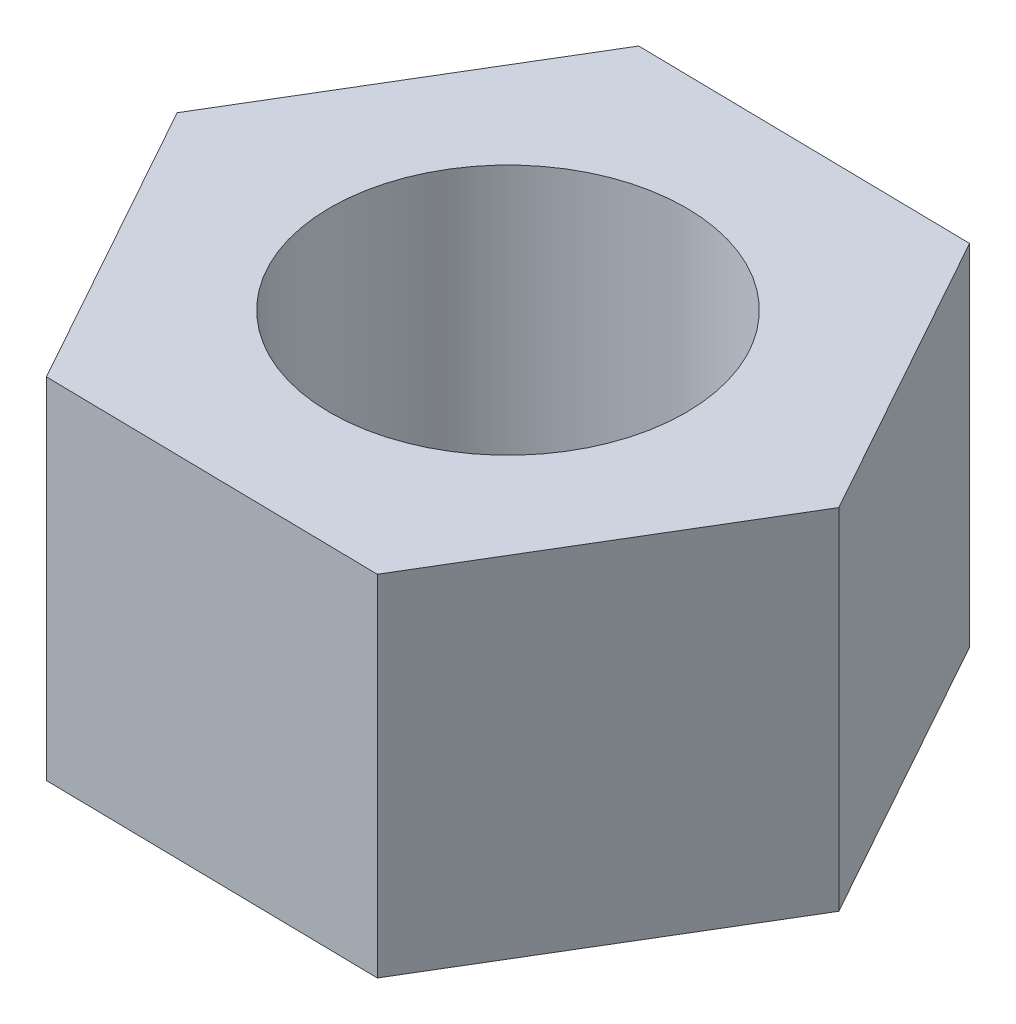
ISO-10303-21;
HEADER;
FILE_DESCRIPTION(('STEP AP214'),'2;1');
FILE_NAME('part.step','',(''),(''),'','','');
FILE_SCHEMA(('AUTOMOTIVE_DESIGN { 1 0 10303 214 1 1 1 1 }'));
ENDSEC;
DATA;
#1=APPLICATION_CONTEXT('core data for automotive mechanical design processes');
#2=APPLICATION_PROTOCOL_DEFINITION('international standard','automotive_design',2000,#1);
#3=PRODUCT_CONTEXT('',#1,'mechanical');
#4=PRODUCT('Part','Part','',(#3));
#5=PRODUCT_RELATED_PRODUCT_CATEGORY('part','',(#4));
#6=PRODUCT_DEFINITION_FORMATION('','',#4);
#7=PRODUCT_DEFINITION_CONTEXT('part definition',#1,'design');
#8=PRODUCT_DEFINITION('design','',#6,#7);
#9=PRODUCT_DEFINITION_SHAPE('','',#8);
#10=(LENGTH_UNIT() NAMED_UNIT(*) SI_UNIT(.MILLI.,.METRE.));
#11=(NAMED_UNIT(*) PLANE_ANGLE_UNIT() SI_UNIT($,.RADIAN.));
#12=(NAMED_UNIT(*) SI_UNIT($,.STERADIAN.) SOLID_ANGLE_UNIT());
#13=UNCERTAINTY_MEASURE_WITH_UNIT(LENGTH_MEASURE(1.E-05),#10,'distance_accuracy_value','');
#14=(GEOMETRIC_REPRESENTATION_CONTEXT(3) GLOBAL_UNCERTAINTY_ASSIGNED_CONTEXT((#13)) GLOBAL_UNIT_ASSIGNED_CONTEXT((#10,
#11,#12)) REPRESENTATION_CONTEXT('',''));
#15=CARTESIAN_POINT('',(0.,0.,0.));
#16=DIRECTION('',(0.,0.,1.));
#17=DIRECTION('',(1.,0.,0.));
#18=AXIS2_PLACEMENT_3D('',#15,#16,#17);
#19=CARTESIAN_POINT('',(-1.484427997689,3.,2.475844674654));
#20=DIRECTION('',(0.016499522491723,0.,-0.999863873613576));
#21=DIRECTION('',(-0.999863873613576,0.,-0.016499522491723));
#22=AXIS2_PLACEMENT_3D('',#19,#20,#21);
#23=PLANE('',#22);
#24=DIRECTION('',(0.999863873613579,0.,0.0164995224915552));
#25=VECTOR('',#24,1.);
#26=CARTESIAN_POINT('',(-1.484427997689,3.,2.475844674654));
#27=LINE('',#26,#25);
#28=CARTESIAN_POINT('',(-1.48442799768877,3.,2.47584467465387));
#29=VERTEX_POINT('',#28);
#30=CARTESIAN_POINT('',(1.40193038523,3.,2.52347469341424));
#31=VERTEX_POINT('',#30);
#32=EDGE_CURVE('E87',#29,#31,#27,.T.);
#33=ORIENTED_EDGE('',*,*,#32,.F.);
#34=DIRECTION('',(0.,1.,0.));
#35=VECTOR('',#34,1.);
#36=CARTESIAN_POINT('',(-1.48442799768855,3.,2.47584467465375));
#37=LINE('',#36,#35);
#38=CARTESIAN_POINT('',(-1.48442799768889,0.,2.47584467465394));
#39=VERTEX_POINT('',#38);
#40=EDGE_CURVE('E78',#29,#39,#37,.F.);
#41=ORIENTED_EDGE('',*,*,#40,.T.);
#42=DIRECTION('',(0.999863873613579,0.,0.0164995224915552));
#43=VECTOR('',#42,1.);
#44=CARTESIAN_POINT('',(-1.484427997689,0.,2.475844674654));
#45=LINE('',#44,#43);
#46=CARTESIAN_POINT('',(1.40193038523,0.,2.52347469341424));
#47=VERTEX_POINT('',#46);
#48=EDGE_CURVE('E106',#39,#47,#45,.T.);
#49=ORIENTED_EDGE('',*,*,#48,.T.);
#50=DIRECTION('',(0.,1.,0.));
#51=VECTOR('',#50,1.);
#52=CARTESIAN_POINT('',(1.40193038523,3.,2.523474693414));
#53=LINE('',#52,#51);
#54=EDGE_CURVE('E101',#47,#31,#53,.T.);
#55=ORIENTED_EDGE('',*,*,#54,.T.);
#56=EDGE_LOOP('',(#33,#41,#49,#55));
#57=FACE_BOUND('',#56,.T.);
#58=ADVANCED_FACE('F17',(#57),#23,.F.);
#59=CARTESIAN_POINT('',(1.40193038523,3.,2.523474693414));
#60=DIRECTION('',(-0.85765775362983,0.,-0.514220942434898));
#61=DIRECTION('',(-0.514220942434898,0.,0.85765775362983));
#62=AXIS2_PLACEMENT_3D('',#59,#60,#61);
#63=PLANE('',#62);
#64=DIRECTION('',(0.514220942435023,0.,-0.857657753629754));
#65=VECTOR('',#64,1.);
#66=CARTESIAN_POINT('',(1.40193038523,3.,2.523474693414));
#67=LINE('',#66,#65);
#68=CARTESIAN_POINT('',(2.88635838291882,3.,0.0476300187603813));
#69=VERTEX_POINT('',#68);
#70=EDGE_CURVE('E89',#31,#69,#67,.T.);
#71=ORIENTED_EDGE('',*,*,#70,.F.);
#72=ORIENTED_EDGE('',*,*,#54,.F.);
#73=DIRECTION('',(0.514220942435023,0.,-0.857657753629754));
#74=VECTOR('',#73,1.);
#75=CARTESIAN_POINT('',(1.40193038523,0.,2.523474693414));
#76=LINE('',#75,#74);
#77=CARTESIAN_POINT('',(2.88635838291882,0.,0.0476300187603813));
#78=VERTEX_POINT('',#77);
#79=EDGE_CURVE('E117',#47,#78,#76,.T.);
#80=ORIENTED_EDGE('',*,*,#79,.T.);
#81=DIRECTION('',(0.,1.,0.));
#82=VECTOR('',#81,1.);
#83=CARTESIAN_POINT('',(2.886358382919,3.,0.04763001876049));
#84=LINE('',#83,#82);
#85=EDGE_CURVE('E98',#78,#69,#84,.T.);
#86=ORIENTED_EDGE('',*,*,#85,.T.);
#87=EDGE_LOOP('',(#71,#72,#80,#86));
#88=FACE_BOUND('',#87,.T.);
#89=ADVANCED_FACE('F110',(#88),#63,.F.);
#90=CARTESIAN_POINT('',(2.886358382919,3.,0.04763001876049));
#91=DIRECTION('',(-0.874157276121491,0.,0.485642931178717));
#92=DIRECTION('',(0.485642931178717,0.,0.874157276121491));
#93=AXIS2_PLACEMENT_3D('',#90,#91,#92);
#94=PLANE('',#93);
#95=DIRECTION('',(-0.48564293117856,0.,-0.874157276121578));
#96=VECTOR('',#95,1.);
#97=CARTESIAN_POINT('',(2.886358382919,3.,0.04763001876049));
#98=LINE('',#97,#96);
#99=CARTESIAN_POINT('',(1.48442799768877,3.,-2.47584467465387));
#100=VERTEX_POINT('',#99);
#101=EDGE_CURVE('E112',#69,#100,#98,.T.);
#102=ORIENTED_EDGE('',*,*,#101,.F.);
#103=ORIENTED_EDGE('',*,*,#85,.F.);
#104=DIRECTION('',(-0.48564293117856,0.,-0.874157276121578));
#105=VECTOR('',#104,1.);
#106=CARTESIAN_POINT('',(2.886358382919,0.,0.04763001876049));
#107=LINE('',#106,#105);
#108=CARTESIAN_POINT('',(1.48442799768877,0.,-2.47584467465387));
#109=VERTEX_POINT('',#108);
#110=EDGE_CURVE('E119',#78,#109,#107,.T.);
#111=ORIENTED_EDGE('',*,*,#110,.T.);
#112=DIRECTION('',(0.,1.,0.));
#113=VECTOR('',#112,1.);
#114=CARTESIAN_POINT('',(1.484427997689,3.,-2.475844674654));
#115=LINE('',#114,#113);
#116=EDGE_CURVE('E95',#109,#100,#115,.T.);
#117=ORIENTED_EDGE('',*,*,#116,.T.);
#118=EDGE_LOOP('',(#102,#103,#111,#117));
#119=FACE_BOUND('',#118,.T.);
#120=ADVANCED_FACE('F144',(#119),#94,.F.);
#121=CARTESIAN_POINT('',(1.484427997689,3.,-2.475844674654));
#122=DIRECTION('',(-0.016499522491723,0.,0.999863873613576));
#123=DIRECTION('',(0.999863873613576,0.,0.016499522491723));
#124=AXIS2_PLACEMENT_3D('',#121,#122,#123);
#125=PLANE('',#124);
#126=DIRECTION('',(-0.999863873613579,0.,-0.0164995224915552));
#127=VECTOR('',#126,1.);
#128=CARTESIAN_POINT('',(1.484427997689,3.,-2.475844674654));
#129=LINE('',#128,#127);
#130=CARTESIAN_POINT('',(-1.40193038523,3.,-2.52347469341412));
#131=VERTEX_POINT('',#130);
#132=EDGE_CURVE('E76',#100,#131,#129,.T.);
#133=ORIENTED_EDGE('',*,*,#132,.F.);
#134=ORIENTED_EDGE('',*,*,#116,.F.);
#135=DIRECTION('',(-0.999863873613579,0.,-0.0164995224915552));
#136=VECTOR('',#135,1.);
#137=CARTESIAN_POINT('',(1.484427997689,0.,-2.475844674654));
#138=LINE('',#137,#136);
#139=CARTESIAN_POINT('',(-1.40193038523,0.,-2.52347469341424));
#140=VERTEX_POINT('',#139);
#141=EDGE_CURVE('E122',#109,#140,#138,.T.);
#142=ORIENTED_EDGE('',*,*,#141,.T.);
#143=DIRECTION('',(0.,1.,0.));
#144=VECTOR('',#143,1.);
#145=CARTESIAN_POINT('',(-1.40193038523,3.,-2.523474693414));
#146=LINE('',#145,#144);
#147=EDGE_CURVE('E66',#140,#131,#146,.T.);
#148=ORIENTED_EDGE('',*,*,#147,.T.);
#149=EDGE_LOOP('',(#133,#134,#142,#148));
#150=FACE_BOUND('',#149,.T.);
#151=ADVANCED_FACE('F142',(#150),#125,.F.);
#152=CARTESIAN_POINT('',(-1.40193038523,3.,-2.523474693414));
#153=DIRECTION('',(0.85765775362983,0.,0.514220942434898));
#154=DIRECTION('',(0.514220942434898,0.,-0.85765775362983));
#155=AXIS2_PLACEMENT_3D('',#152,#153,#154);
#156=PLANE('',#155);
#157=DIRECTION('',(-0.514220942435023,0.,0.857657753629754));
#158=VECTOR('',#157,1.);
#159=CARTESIAN_POINT('',(-1.40193038523,3.,-2.523474693414));
#160=LINE('',#159,#158);
#161=CARTESIAN_POINT('',(-2.88635838291882,3.,-0.0476300187603813));
#162=VERTEX_POINT('',#161);
#163=EDGE_CURVE('E72',#131,#162,#160,.T.);
#164=ORIENTED_EDGE('',*,*,#163,.F.);
#165=ORIENTED_EDGE('',*,*,#147,.F.);
#166=DIRECTION('',(-0.514220942435023,0.,0.857657753629754));
#167=VECTOR('',#166,1.);
#168=CARTESIAN_POINT('',(-1.40193038523,0.,-2.523474693414));
#169=LINE('',#168,#167);
#170=CARTESIAN_POINT('',(-2.88635838291882,0.,-0.0476300187603813));
#171=VERTEX_POINT('',#170);
#172=EDGE_CURVE('E83',#140,#171,#169,.T.);
#173=ORIENTED_EDGE('',*,*,#172,.T.);
#174=DIRECTION('',(0.,1.,0.));
#175=VECTOR('',#174,1.);
#176=CARTESIAN_POINT('',(-2.886358382919,3.,-0.04763001876049));
#177=LINE('',#176,#175);
#178=EDGE_CURVE('E33',#171,#162,#177,.T.);
#179=ORIENTED_EDGE('',*,*,#178,.T.);
#180=EDGE_LOOP('',(#164,#165,#173,#179));
#181=FACE_BOUND('',#180,.T.);
#182=ADVANCED_FACE('F81',(#181),#156,.F.);
#183=CARTESIAN_POINT('',(-2.886358382919,3.,-0.04763001876049));
#184=DIRECTION('',(0.874157276121491,0.,-0.485642931178717));
#185=DIRECTION('',(-0.485642931178717,0.,-0.874157276121491));
#186=AXIS2_PLACEMENT_3D('',#183,#184,#185);
#187=PLANE('',#186);
#188=DIRECTION('',(0.48564293117856,0.,0.874157276121578));
#189=VECTOR('',#188,1.);
#190=CARTESIAN_POINT('',(-2.886358382919,3.,-0.04763001876049));
#191=LINE('',#190,#189);
#192=EDGE_CURVE('E74',#162,#29,#191,.T.);
#193=ORIENTED_EDGE('',*,*,#192,.F.);
#194=ORIENTED_EDGE('',*,*,#178,.F.);
#195=DIRECTION('',(0.48564293117856,0.,0.874157276121578));
#196=VECTOR('',#195,1.);
#197=CARTESIAN_POINT('',(-2.886358382919,0.,-0.04763001876049));
#198=LINE('',#197,#196);
#199=EDGE_CURVE('E125',#171,#39,#198,.T.);
#200=ORIENTED_EDGE('',*,*,#199,.T.);
#201=ORIENTED_EDGE('',*,*,#40,.F.);
#202=EDGE_LOOP('',(#193,#194,#200,#201));
#203=FACE_BOUND('',#202,.T.);
#204=ADVANCED_FACE('F85',(#203),#187,.F.);
#205=CARTESIAN_POINT('',(0.,3.,0.));
#206=DIRECTION('',(0.,1.,0.));
#207=DIRECTION('',(0.,0.,1.));
#208=AXIS2_PLACEMENT_3D('',#205,#206,#207);
#209=PLANE('',#208);
#210=CARTESIAN_POINT('',(0.,3.,0.));
#211=DIRECTION('',(0.,1.,0.));
#212=DIRECTION('',(0.,0.,1.));
#213=AXIS2_PLACEMENT_3D('',#210,#211,#212);
#214=CIRCLE('',#213,1.525);
#215=CARTESIAN_POINT('',(0.,3.,1.525));
#216=VERTEX_POINT('',#215);
#217=EDGE_CURVE('E20',#216,#216,#214,.F.);
#218=ORIENTED_EDGE('',*,*,#217,.T.);
#219=EDGE_LOOP('',(#218));
#220=FACE_BOUND('',#219,.T.);
#221=ORIENTED_EDGE('',*,*,#101,.T.);
#222=ORIENTED_EDGE('',*,*,#132,.T.);
#223=ORIENTED_EDGE('',*,*,#163,.T.);
#224=ORIENTED_EDGE('',*,*,#192,.T.);
#225=ORIENTED_EDGE('',*,*,#32,.T.);
#226=ORIENTED_EDGE('',*,*,#70,.T.);
#227=EDGE_LOOP('',(#221,#222,#223,#224,#225,#226));
#228=FACE_BOUND('',#227,.T.);
#229=ADVANCED_FACE('F73',(#220,#228),#209,.T.);
#230=CARTESIAN_POINT('',(0.,0.,0.));
#231=DIRECTION('',(0.,1.,0.));
#232=DIRECTION('',(0.,0.,1.));
#233=AXIS2_PLACEMENT_3D('',#230,#231,#232);
#234=PLANE('',#233);
#235=CARTESIAN_POINT('',(0.,0.,0.));
#236=DIRECTION('',(0.,1.,0.));
#237=DIRECTION('',(0.,0.,1.));
#238=AXIS2_PLACEMENT_3D('',#235,#236,#237);
#239=CIRCLE('',#238,1.525);
#240=CARTESIAN_POINT('',(0.,0.,1.525));
#241=VERTEX_POINT('',#240);
#242=EDGE_CURVE('E11',#241,#241,#239,.T.);
#243=ORIENTED_EDGE('',*,*,#242,.T.);
#244=EDGE_LOOP('',(#243));
#245=FACE_BOUND('',#244,.T.);
#246=ORIENTED_EDGE('',*,*,#172,.F.);
#247=ORIENTED_EDGE('',*,*,#141,.F.);
#248=ORIENTED_EDGE('',*,*,#110,.F.);
#249=ORIENTED_EDGE('',*,*,#79,.F.);
#250=ORIENTED_EDGE('',*,*,#48,.F.);
#251=ORIENTED_EDGE('',*,*,#199,.F.);
#252=EDGE_LOOP('',(#246,#247,#248,#249,#250,#251));
#253=FACE_BOUND('',#252,.T.);
#254=ADVANCED_FACE('F133',(#245,#253),#234,.F.);
#255=CARTESIAN_POINT('',(0.,-2.,0.));
#256=DIRECTION('',(0.,1.,0.));
#257=DIRECTION('',(0.,0.,1.));
#258=AXIS2_PLACEMENT_3D('',#255,#256,#257);
#259=CYLINDRICAL_SURFACE('',#258,1.525);
#260=ORIENTED_EDGE('',*,*,#217,.F.);
#261=EDGE_LOOP('',(#260));
#262=FACE_BOUND('',#261,.T.);
#263=ORIENTED_EDGE('',*,*,#242,.F.);
#264=EDGE_LOOP('',(#263));
#265=FACE_BOUND('',#264,.T.);
#266=ADVANCED_FACE('F130',(#262,#265),#259,.F.);
#267=CLOSED_SHELL('',(#58,#89,#120,#151,#182,#204,#229,#254,#266));
#268=MANIFOLD_SOLID_BREP('B1',#267);
#269=ADVANCED_BREP_SHAPE_REPRESENTATION('',(#18,#268),#14);
#270=SHAPE_DEFINITION_REPRESENTATION(#9,#269);
ENDSEC;
END-ISO-10303-21;
